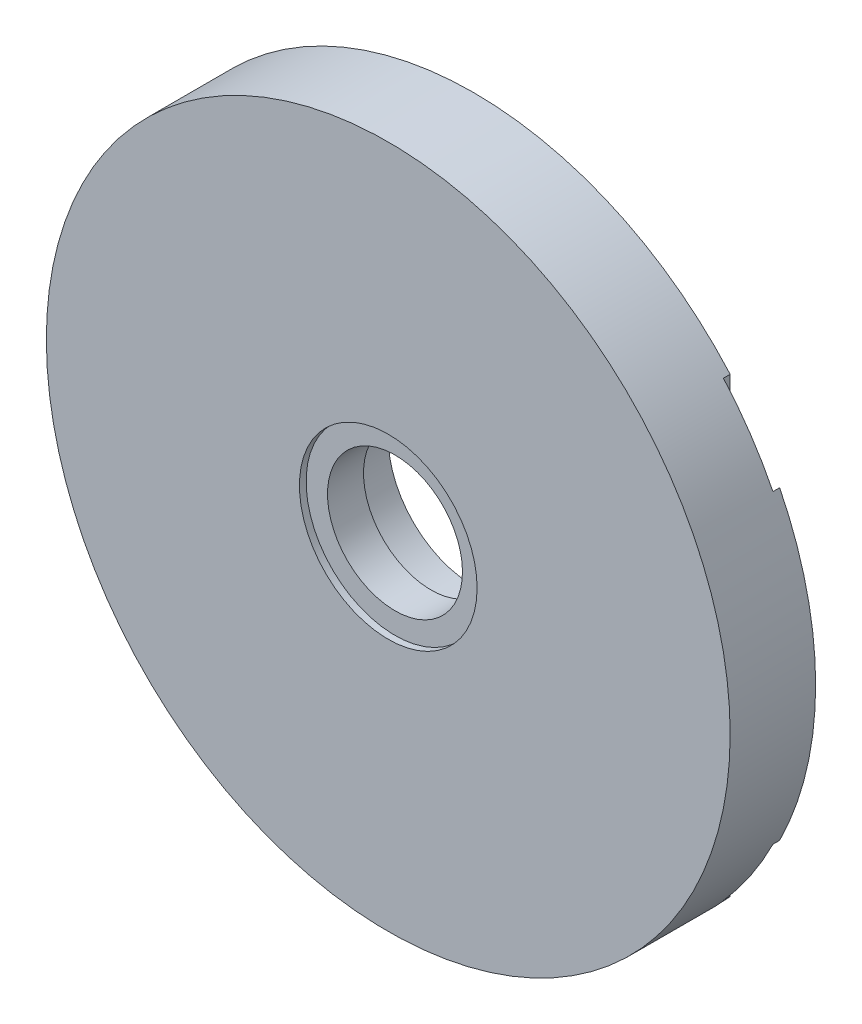
ISO-10303-21;
HEADER;
FILE_DESCRIPTION(('STEP AP214'),'2;1');
FILE_NAME('part.step','',(''),(''),'','','');
FILE_SCHEMA(('AUTOMOTIVE_DESIGN { 1 0 10303 214 1 1 1 1 }'));
ENDSEC;
DATA;
#1=APPLICATION_CONTEXT('core data for automotive mechanical design processes');
#2=APPLICATION_PROTOCOL_DEFINITION('international standard','automotive_design',2000,#1);
#3=PRODUCT_CONTEXT('',#1,'mechanical');
#4=PRODUCT('Part','Part','',(#3));
#5=PRODUCT_RELATED_PRODUCT_CATEGORY('part','',(#4));
#6=PRODUCT_DEFINITION_FORMATION('','',#4);
#7=PRODUCT_DEFINITION_CONTEXT('part definition',#1,'design');
#8=PRODUCT_DEFINITION('design','',#6,#7);
#9=PRODUCT_DEFINITION_SHAPE('','',#8);
#10=(LENGTH_UNIT() NAMED_UNIT(*) SI_UNIT(.MILLI.,.METRE.));
#11=(NAMED_UNIT(*) PLANE_ANGLE_UNIT() SI_UNIT($,.RADIAN.));
#12=(NAMED_UNIT(*) SI_UNIT($,.STERADIAN.) SOLID_ANGLE_UNIT());
#13=UNCERTAINTY_MEASURE_WITH_UNIT(LENGTH_MEASURE(1.E-05),#10,'distance_accuracy_value','');
#14=(GEOMETRIC_REPRESENTATION_CONTEXT(3) GLOBAL_UNCERTAINTY_ASSIGNED_CONTEXT((#13)) GLOBAL_UNIT_ASSIGNED_CONTEXT((#10,
#11,#12)) REPRESENTATION_CONTEXT('',''));
#15=CARTESIAN_POINT('',(0.,0.,0.));
#16=DIRECTION('',(0.,0.,1.));
#17=DIRECTION('',(1.,0.,0.));
#18=AXIS2_PLACEMENT_3D('',#15,#16,#17);
#19=CARTESIAN_POINT('',(0.,0.,12.7));
#20=DIRECTION('',(0.,0.,-1.));
#21=DIRECTION('',(-1.,0.,0.));
#22=AXIS2_PLACEMENT_3D('',#19,#20,#21);
#23=CYLINDRICAL_SURFACE('',#22,50.8);
#24=CARTESIAN_POINT('',(0.,0.,12.7));
#25=DIRECTION('',(0.,0.,1.));
#26=DIRECTION('',(1.,0.,0.));
#27=AXIS2_PLACEMENT_3D('',#24,#25,#26);
#28=CIRCLE('',#27,50.8);
#29=CARTESIAN_POINT('',(50.8,0.,12.7));
#30=VERTEX_POINT('',#29);
#31=EDGE_CURVE('E12',#30,#30,#28,.T.);
#32=ORIENTED_EDGE('',*,*,#31,.F.);
#33=EDGE_LOOP('',(#32));
#34=FACE_BOUND('',#33,.T.);
#35=DIRECTION('',(0.,0.,-1.));
#36=VECTOR('',#35,1.);
#37=CARTESIAN_POINT('',(-38.1,33.6010416505203,1.));
#38=LINE('',#37,#36);
#39=CARTESIAN_POINT('',(-38.1,33.6010416505203,1.));
#40=VERTEX_POINT('',#39);
#41=CARTESIAN_POINT('',(-38.1,33.6010416505203,0.));
#42=VERTEX_POINT('',#41);
#43=EDGE_CURVE('E145',#40,#42,#38,.T.);
#44=ORIENTED_EDGE('',*,*,#43,.F.);
#45=CARTESIAN_POINT('',(0.,0.,1.));
#46=DIRECTION('',(0.,0.,-1.));
#47=DIRECTION('',(-1.,0.,0.));
#48=AXIS2_PLACEMENT_3D('',#45,#46,#47);
#49=CIRCLE('',#48,50.8);
#50=CARTESIAN_POINT('',(-45.45,22.6922343545099,1.));
#51=VERTEX_POINT('',#50);
#52=EDGE_CURVE('E125',#51,#40,#49,.T.);
#53=ORIENTED_EDGE('',*,*,#52,.F.);
#54=DIRECTION('',(0.,0.,-1.));
#55=VECTOR('',#54,1.);
#56=CARTESIAN_POINT('',(-45.45,22.6922343545099,1.));
#57=LINE('',#56,#55);
#58=CARTESIAN_POINT('',(-45.45,22.6922343545099,0.));
#59=VERTEX_POINT('',#58);
#60=EDGE_CURVE('E120',#51,#59,#57,.T.);
#61=ORIENTED_EDGE('',*,*,#60,.T.);
#62=CARTESIAN_POINT('',(0.,0.,0.));
#63=DIRECTION('',(0.,0.,1.));
#64=DIRECTION('',(1.,0.,0.));
#65=AXIS2_PLACEMENT_3D('',#62,#63,#64);
#66=CIRCLE('',#65,50.8);
#67=CARTESIAN_POINT('',(-45.45,-22.6922343545099,0.));
#68=VERTEX_POINT('',#67);
#69=EDGE_CURVE('E140',#59,#68,#66,.T.);
#70=ORIENTED_EDGE('',*,*,#69,.T.);
#71=DIRECTION('',(0.,0.,-1.));
#72=VECTOR('',#71,1.);
#73=CARTESIAN_POINT('',(-45.45,-22.6922343545099,1.));
#74=LINE('',#73,#72);
#75=CARTESIAN_POINT('',(-45.45,-22.6922343545099,1.));
#76=VERTEX_POINT('',#75);
#77=EDGE_CURVE('E76',#76,#68,#74,.T.);
#78=ORIENTED_EDGE('',*,*,#77,.F.);
#79=CARTESIAN_POINT('',(-38.1,-33.6010416505203,1.));
#80=VERTEX_POINT('',#79);
#81=EDGE_CURVE('E126',#80,#76,#49,.T.);
#82=ORIENTED_EDGE('',*,*,#81,.F.);
#83=DIRECTION('',(0.,0.,-1.));
#84=VECTOR('',#83,1.);
#85=CARTESIAN_POINT('',(-38.1,-33.6010416505203,1.));
#86=LINE('',#85,#84);
#87=CARTESIAN_POINT('',(-38.1,-33.6010416505203,0.));
#88=VERTEX_POINT('',#87);
#89=EDGE_CURVE('E195',#80,#88,#86,.T.);
#90=ORIENTED_EDGE('',*,*,#89,.T.);
#91=CARTESIAN_POINT('',(38.1,-33.6010416505203,0.));
#92=VERTEX_POINT('',#91);
#93=EDGE_CURVE('E240',#88,#92,#66,.T.);
#94=ORIENTED_EDGE('',*,*,#93,.T.);
#95=DIRECTION('',(0.,0.,-1.));
#96=VECTOR('',#95,1.);
#97=CARTESIAN_POINT('',(38.1,-33.6010416505203,1.));
#98=LINE('',#97,#96);
#99=CARTESIAN_POINT('',(38.1,-33.6010416505203,1.));
#100=VERTEX_POINT('',#99);
#101=EDGE_CURVE('E68',#100,#92,#98,.T.);
#102=ORIENTED_EDGE('',*,*,#101,.F.);
#103=CARTESIAN_POINT('',(0.,0.,1.));
#104=DIRECTION('',(0.,0.,-1.));
#105=DIRECTION('',(-1.,0.,0.));
#106=AXIS2_PLACEMENT_3D('',#103,#104,#105);
#107=CIRCLE('',#106,50.8);
#108=CARTESIAN_POINT('',(45.45,-22.6922343545099,1.));
#109=VERTEX_POINT('',#108);
#110=EDGE_CURVE('E153',#109,#100,#107,.T.);
#111=ORIENTED_EDGE('',*,*,#110,.F.);
#112=DIRECTION('',(0.,0.,-1.));
#113=VECTOR('',#112,1.);
#114=CARTESIAN_POINT('',(45.45,-22.6922343545099,1.));
#115=LINE('',#114,#113);
#116=CARTESIAN_POINT('',(45.45,-22.6922343545099,0.));
#117=VERTEX_POINT('',#116);
#118=EDGE_CURVE('E178',#109,#117,#115,.T.);
#119=ORIENTED_EDGE('',*,*,#118,.T.);
#120=CARTESIAN_POINT('',(45.45,22.6922343545099,0.));
#121=VERTEX_POINT('',#120);
#122=EDGE_CURVE('E55',#117,#121,#66,.T.);
#123=ORIENTED_EDGE('',*,*,#122,.T.);
#124=DIRECTION('',(0.,0.,-1.));
#125=VECTOR('',#124,1.);
#126=CARTESIAN_POINT('',(45.45,22.6922343545099,1.));
#127=LINE('',#126,#125);
#128=CARTESIAN_POINT('',(45.45,22.6922343545099,1.));
#129=VERTEX_POINT('',#128);
#130=EDGE_CURVE('E168',#129,#121,#127,.T.);
#131=ORIENTED_EDGE('',*,*,#130,.F.);
#132=CARTESIAN_POINT('',(38.1,33.6010416505203,1.));
#133=VERTEX_POINT('',#132);
#134=EDGE_CURVE('E159',#133,#129,#107,.T.);
#135=ORIENTED_EDGE('',*,*,#134,.F.);
#136=DIRECTION('',(0.,0.,-1.));
#137=VECTOR('',#136,1.);
#138=CARTESIAN_POINT('',(38.1,33.6010416505203,1.));
#139=LINE('',#138,#137);
#140=CARTESIAN_POINT('',(38.1,33.6010416505203,0.));
#141=VERTEX_POINT('',#140);
#142=EDGE_CURVE('E172',#133,#141,#139,.T.);
#143=ORIENTED_EDGE('',*,*,#142,.T.);
#144=EDGE_CURVE('E61',#141,#42,#66,.T.);
#145=ORIENTED_EDGE('',*,*,#144,.T.);
#146=EDGE_LOOP('',(#44,#53,#61,#70,#78,#82,#90,#94,#102,#111,#119,#123,#131,#135,#143,#145));
#147=FACE_BOUND('',#146,.T.);
#148=ADVANCED_FACE('F52',(#34,#147),#23,.T.);
#149=CARTESIAN_POINT('',(0.,0.,0.));
#150=DIRECTION('',(0.,0.,1.));
#151=DIRECTION('',(1.,0.,0.));
#152=AXIS2_PLACEMENT_3D('',#149,#150,#151);
#153=PLANE('',#152);
#154=CARTESIAN_POINT('',(0.,0.,0.));
#155=DIRECTION('',(0.,0.,1.));
#156=DIRECTION('',(1.,0.,0.));
#157=AXIS2_PLACEMENT_3D('',#154,#155,#156);
#158=CIRCLE('',#157,12.7);
#159=CARTESIAN_POINT('',(12.7,0.,0.));
#160=VERTEX_POINT('',#159);
#161=EDGE_CURVE('E187',#160,#160,#158,.T.);
#162=ORIENTED_EDGE('',*,*,#161,.T.);
#163=EDGE_LOOP('',(#162));
#164=FACE_BOUND('',#163,.T.);
#165=DIRECTION('',(0.,1.,0.));
#166=VECTOR('',#165,1.);
#167=CARTESIAN_POINT('',(-38.1,0.,0.));
#168=LINE('',#167,#166);
#169=EDGE_CURVE('E135',#88,#42,#168,.T.);
#170=ORIENTED_EDGE('',*,*,#169,.T.);
#171=ORIENTED_EDGE('',*,*,#144,.F.);
#172=DIRECTION('',(0.,-1.,0.));
#173=VECTOR('',#172,1.);
#174=CARTESIAN_POINT('',(38.1,0.,0.));
#175=LINE('',#174,#173);
#176=EDGE_CURVE('E154',#141,#92,#175,.T.);
#177=ORIENTED_EDGE('',*,*,#176,.T.);
#178=ORIENTED_EDGE('',*,*,#93,.F.);
#179=EDGE_LOOP('',(#170,#171,#177,#178));
#180=FACE_BOUND('',#179,.T.);
#181=ADVANCED_FACE('F218',(#164,#180),#153,.F.);
#182=DIRECTION('',(0.,1.,0.));
#183=VECTOR('',#182,1.);
#184=CARTESIAN_POINT('',(45.45,0.,0.));
#185=LINE('',#184,#183);
#186=EDGE_CURVE('E162',#117,#121,#185,.T.);
#187=ORIENTED_EDGE('',*,*,#186,.T.);
#188=ORIENTED_EDGE('',*,*,#122,.F.);
#189=EDGE_LOOP('',(#187,#188));
#190=FACE_BOUND('',#189,.T.);
#191=ADVANCED_FACE('F223',(#190),#153,.F.);
#192=ORIENTED_EDGE('',*,*,#69,.F.);
#193=DIRECTION('',(0.,1.,0.));
#194=VECTOR('',#193,1.);
#195=CARTESIAN_POINT('',(-45.45,0.,0.));
#196=LINE('',#195,#194);
#197=EDGE_CURVE('E171',#68,#59,#196,.T.);
#198=ORIENTED_EDGE('',*,*,#197,.F.);
#199=EDGE_LOOP('',(#192,#198));
#200=FACE_BOUND('',#199,.T.);
#201=ADVANCED_FACE('F226',(#200),#153,.F.);
#202=CARTESIAN_POINT('',(0.,0.,12.7));
#203=DIRECTION('',(0.,0.,-1.));
#204=DIRECTION('',(-1.,0.,0.));
#205=AXIS2_PLACEMENT_3D('',#202,#203,#204);
#206=CYLINDRICAL_SURFACE('',#205,10.025);
#207=CARTESIAN_POINT('',(0.,0.,6.35));
#208=DIRECTION('',(0.,0.,1.));
#209=DIRECTION('',(1.,0.,0.));
#210=AXIS2_PLACEMENT_3D('',#207,#208,#209);
#211=CIRCLE('',#210,10.025);
#212=CARTESIAN_POINT('',(10.025,0.,6.35));
#213=VERTEX_POINT('',#212);
#214=EDGE_CURVE('E182',#213,#213,#211,.T.);
#215=ORIENTED_EDGE('',*,*,#214,.F.);
#216=EDGE_LOOP('',(#215));
#217=FACE_BOUND('',#216,.T.);
#218=CARTESIAN_POINT('',(0.,0.,11.7));
#219=DIRECTION('',(0.,0.,1.));
#220=DIRECTION('',(1.,0.,0.));
#221=AXIS2_PLACEMENT_3D('',#218,#219,#220);
#222=CIRCLE('',#221,10.025);
#223=CARTESIAN_POINT('',(10.025,0.,11.7));
#224=VERTEX_POINT('',#223);
#225=EDGE_CURVE('E191',#224,#224,#222,.T.);
#226=ORIENTED_EDGE('',*,*,#225,.T.);
#227=EDGE_LOOP('',(#226));
#228=FACE_BOUND('',#227,.T.);
#229=ADVANCED_FACE('F213',(#217,#228),#206,.F.);
#230=CARTESIAN_POINT('',(0.,0.,12.7));
#231=DIRECTION('',(0.,0.,1.));
#232=DIRECTION('',(1.,0.,0.));
#233=AXIS2_PLACEMENT_3D('',#230,#231,#232);
#234=PLANE('',#233);
#235=CARTESIAN_POINT('',(0.,0.,12.7));
#236=DIRECTION('',(0.,0.,1.));
#237=DIRECTION('',(1.,0.,0.));
#238=AXIS2_PLACEMENT_3D('',#235,#236,#237);
#239=CIRCLE('',#238,13.2);
#240=CARTESIAN_POINT('',(13.2,0.,12.7));
#241=VERTEX_POINT('',#240);
#242=EDGE_CURVE('E199',#241,#241,#239,.T.);
#243=ORIENTED_EDGE('',*,*,#242,.F.);
#244=EDGE_LOOP('',(#243));
#245=FACE_BOUND('',#244,.T.);
#246=ORIENTED_EDGE('',*,*,#31,.T.);
#247=EDGE_LOOP('',(#246));
#248=FACE_BOUND('',#247,.T.);
#249=ADVANCED_FACE('F210',(#245,#248),#234,.T.);
#250=CARTESIAN_POINT('',(0.,0.,11.7));
#251=DIRECTION('',(0.,0.,1.));
#252=DIRECTION('',(1.,0.,0.));
#253=AXIS2_PLACEMENT_3D('',#250,#251,#252);
#254=CYLINDRICAL_SURFACE('',#253,13.2);
#255=CARTESIAN_POINT('',(0.,0.,11.7));
#256=DIRECTION('',(0.,0.,1.));
#257=DIRECTION('',(1.,0.,0.));
#258=AXIS2_PLACEMENT_3D('',#255,#256,#257);
#259=CIRCLE('',#258,13.2);
#260=CARTESIAN_POINT('',(13.2,0.,11.7));
#261=VERTEX_POINT('',#260);
#262=EDGE_CURVE('E200',#261,#261,#259,.T.);
#263=ORIENTED_EDGE('',*,*,#262,.F.);
#264=EDGE_LOOP('',(#263));
#265=FACE_BOUND('',#264,.T.);
#266=ORIENTED_EDGE('',*,*,#242,.T.);
#267=EDGE_LOOP('',(#266));
#268=FACE_BOUND('',#267,.T.);
#269=ADVANCED_FACE('F208',(#265,#268),#254,.F.);
#270=CARTESIAN_POINT('',(0.,0.,11.7));
#271=DIRECTION('',(0.,0.,1.));
#272=DIRECTION('',(1.,0.,0.));
#273=AXIS2_PLACEMENT_3D('',#270,#271,#272);
#274=PLANE('',#273);
#275=ORIENTED_EDGE('',*,*,#225,.F.);
#276=EDGE_LOOP('',(#275));
#277=FACE_BOUND('',#276,.T.);
#278=ORIENTED_EDGE('',*,*,#262,.T.);
#279=EDGE_LOOP('',(#278));
#280=FACE_BOUND('',#279,.T.);
#281=ADVANCED_FACE('F288',(#277,#280),#274,.T.);
#282=CARTESIAN_POINT('',(0.,0.,6.35));
#283=DIRECTION('',(0.,0.,-1.));
#284=DIRECTION('',(-1.,0.,0.));
#285=AXIS2_PLACEMENT_3D('',#282,#283,#284);
#286=CYLINDRICAL_SURFACE('',#285,12.7);
#287=CARTESIAN_POINT('',(0.,0.,6.35));
#288=DIRECTION('',(0.,0.,1.));
#289=DIRECTION('',(1.,0.,0.));
#290=AXIS2_PLACEMENT_3D('',#287,#288,#289);
#291=CIRCLE('',#290,12.7);
#292=CARTESIAN_POINT('',(12.7,0.,6.35));
#293=VERTEX_POINT('',#292);
#294=EDGE_CURVE('E186',#293,#293,#291,.T.);
#295=ORIENTED_EDGE('',*,*,#294,.T.);
#296=EDGE_LOOP('',(#295));
#297=FACE_BOUND('',#296,.T.);
#298=ORIENTED_EDGE('',*,*,#161,.F.);
#299=EDGE_LOOP('',(#298));
#300=FACE_BOUND('',#299,.T.);
#301=ADVANCED_FACE('F284',(#297,#300),#286,.F.);
#302=CARTESIAN_POINT('',(0.,0.,6.35));
#303=DIRECTION('',(0.,0.,1.));
#304=DIRECTION('',(1.,0.,0.));
#305=AXIS2_PLACEMENT_3D('',#302,#303,#304);
#306=PLANE('',#305);
#307=ORIENTED_EDGE('',*,*,#214,.T.);
#308=EDGE_LOOP('',(#307));
#309=FACE_BOUND('',#308,.T.);
#310=ORIENTED_EDGE('',*,*,#294,.F.);
#311=EDGE_LOOP('',(#310));
#312=FACE_BOUND('',#311,.T.);
#313=ADVANCED_FACE('F279',(#309,#312),#306,.F.);
#314=CARTESIAN_POINT('',(45.45,0.,1.));
#315=DIRECTION('',(-1.,0.,0.));
#316=DIRECTION('',(0.,-1.,0.));
#317=AXIS2_PLACEMENT_3D('',#314,#315,#316);
#318=PLANE('',#317);
#319=ORIENTED_EDGE('',*,*,#186,.F.);
#320=ORIENTED_EDGE('',*,*,#118,.F.);
#321=DIRECTION('',(0.,1.,0.));
#322=VECTOR('',#321,1.);
#323=CARTESIAN_POINT('',(45.45,0.,1.));
#324=LINE('',#323,#322);
#325=EDGE_CURVE('E150',#109,#129,#324,.T.);
#326=ORIENTED_EDGE('',*,*,#325,.T.);
#327=ORIENTED_EDGE('',*,*,#130,.T.);
#328=EDGE_LOOP('',(#319,#320,#326,#327));
#329=FACE_BOUND('',#328,.T.);
#330=ADVANCED_FACE('F253',(#329),#318,.T.);
#331=CARTESIAN_POINT('',(38.1,0.,1.));
#332=DIRECTION('',(1.,0.,0.));
#333=DIRECTION('',(0.,0.,-1.));
#334=AXIS2_PLACEMENT_3D('',#331,#332,#333);
#335=PLANE('',#334);
#336=ORIENTED_EDGE('',*,*,#176,.F.);
#337=ORIENTED_EDGE('',*,*,#142,.F.);
#338=DIRECTION('',(0.,-1.,0.));
#339=VECTOR('',#338,1.);
#340=CARTESIAN_POINT('',(38.1,0.,1.));
#341=LINE('',#340,#339);
#342=EDGE_CURVE('E158',#133,#100,#341,.T.);
#343=ORIENTED_EDGE('',*,*,#342,.T.);
#344=ORIENTED_EDGE('',*,*,#101,.T.);
#345=EDGE_LOOP('',(#336,#337,#343,#344));
#346=FACE_BOUND('',#345,.T.);
#347=ADVANCED_FACE('F272',(#346),#335,.T.);
#348=CARTESIAN_POINT('',(0.,0.,1.));
#349=DIRECTION('',(0.,0.,-1.));
#350=DIRECTION('',(-1.,0.,0.));
#351=AXIS2_PLACEMENT_3D('',#348,#349,#350);
#352=PLANE('',#351);
#353=ORIENTED_EDGE('',*,*,#325,.F.);
#354=ORIENTED_EDGE('',*,*,#110,.T.);
#355=ORIENTED_EDGE('',*,*,#342,.F.);
#356=ORIENTED_EDGE('',*,*,#134,.T.);
#357=EDGE_LOOP('',(#353,#354,#355,#356));
#358=FACE_BOUND('',#357,.T.);
#359=ADVANCED_FACE('F258',(#358),#352,.T.);
#360=CARTESIAN_POINT('',(-38.1,0.,1.));
#361=DIRECTION('',(-1.,0.,0.));
#362=DIRECTION('',(0.,-1.,0.));
#363=AXIS2_PLACEMENT_3D('',#360,#361,#362);
#364=PLANE('',#363);
#365=ORIENTED_EDGE('',*,*,#169,.F.);
#366=ORIENTED_EDGE('',*,*,#89,.F.);
#367=DIRECTION('',(0.,1.,0.));
#368=VECTOR('',#367,1.);
#369=CARTESIAN_POINT('',(-38.1,0.,1.));
#370=LINE('',#369,#368);
#371=EDGE_CURVE('E131',#80,#40,#370,.T.);
#372=ORIENTED_EDGE('',*,*,#371,.T.);
#373=ORIENTED_EDGE('',*,*,#43,.T.);
#374=EDGE_LOOP('',(#365,#366,#372,#373));
#375=FACE_BOUND('',#374,.T.);
#376=ADVANCED_FACE('F270',(#375),#364,.T.);
#377=CARTESIAN_POINT('',(-45.45,0.,1.));
#378=DIRECTION('',(-1.,0.,0.));
#379=DIRECTION('',(0.,-1.,0.));
#380=AXIS2_PLACEMENT_3D('',#377,#378,#379);
#381=PLANE('',#380);
#382=ORIENTED_EDGE('',*,*,#197,.T.);
#383=ORIENTED_EDGE('',*,*,#60,.F.);
#384=DIRECTION('',(0.,1.,0.));
#385=VECTOR('',#384,1.);
#386=CARTESIAN_POINT('',(-45.45,0.,1.));
#387=LINE('',#386,#385);
#388=EDGE_CURVE('E116',#76,#51,#387,.T.);
#389=ORIENTED_EDGE('',*,*,#388,.F.);
#390=ORIENTED_EDGE('',*,*,#77,.T.);
#391=EDGE_LOOP('',(#382,#383,#389,#390));
#392=FACE_BOUND('',#391,.T.);
#393=ADVANCED_FACE('F118',(#392),#381,.F.);
#394=CARTESIAN_POINT('',(0.,0.,1.));
#395=DIRECTION('',(0.,0.,-1.));
#396=DIRECTION('',(-1.,0.,0.));
#397=AXIS2_PLACEMENT_3D('',#394,#395,#396);
#398=PLANE('',#397);
#399=ORIENTED_EDGE('',*,*,#81,.T.);
#400=ORIENTED_EDGE('',*,*,#388,.T.);
#401=ORIENTED_EDGE('',*,*,#52,.T.);
#402=ORIENTED_EDGE('',*,*,#371,.F.);
#403=EDGE_LOOP('',(#399,#400,#401,#402));
#404=FACE_BOUND('',#403,.T.);
#405=ADVANCED_FACE('F130',(#404),#398,.T.);
#406=CLOSED_SHELL('',(#148,#181,#191,#201,#229,#249,#269,#281,#301,#313,#330,#347,#359,#376,
#393,#405));
#407=MANIFOLD_SOLID_BREP('B2',#406);
#408=ADVANCED_BREP_SHAPE_REPRESENTATION('',(#18,#407),#14);
#409=SHAPE_DEFINITION_REPRESENTATION(#9,#408);
ENDSEC;
END-ISO-10303-21;
